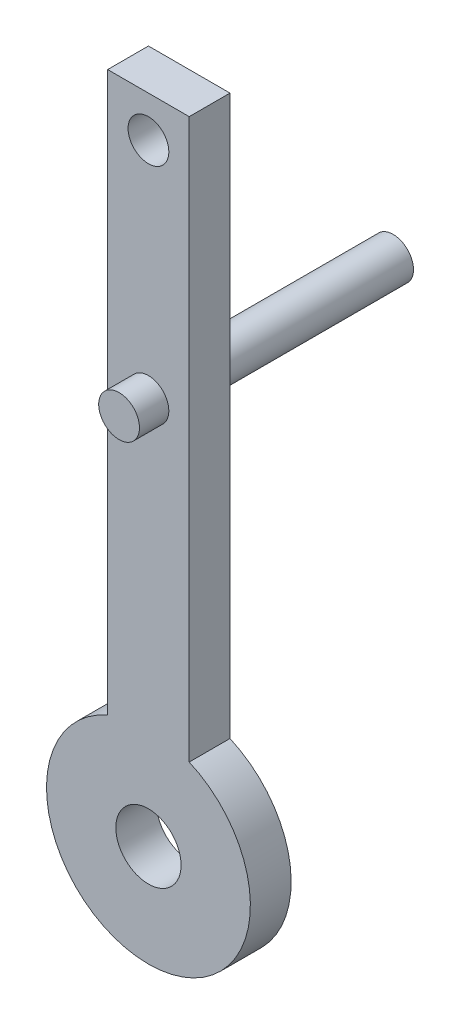
ISO-10303-21;
HEADER;
FILE_DESCRIPTION(('STEP AP214'),'2;1');
FILE_NAME('part.step','',(''),(''),'','','');
FILE_SCHEMA(('AUTOMOTIVE_DESIGN { 1 0 10303 214 1 1 1 1 }'));
ENDSEC;
DATA;
#1=APPLICATION_CONTEXT('core data for automotive mechanical design processes');
#2=APPLICATION_PROTOCOL_DEFINITION('international standard','automotive_design',2000,#1);
#3=PRODUCT_CONTEXT('',#1,'mechanical');
#4=PRODUCT('Part','Part','',(#3));
#5=PRODUCT_RELATED_PRODUCT_CATEGORY('part','',(#4));
#6=PRODUCT_DEFINITION_FORMATION('','',#4);
#7=PRODUCT_DEFINITION_CONTEXT('part definition',#1,'design');
#8=PRODUCT_DEFINITION('design','',#6,#7);
#9=PRODUCT_DEFINITION_SHAPE('','',#8);
#10=(LENGTH_UNIT() NAMED_UNIT(*) SI_UNIT(.MILLI.,.METRE.));
#11=(NAMED_UNIT(*) PLANE_ANGLE_UNIT() SI_UNIT($,.RADIAN.));
#12=(NAMED_UNIT(*) SI_UNIT($,.STERADIAN.) SOLID_ANGLE_UNIT());
#13=UNCERTAINTY_MEASURE_WITH_UNIT(LENGTH_MEASURE(1.E-05),#10,'distance_accuracy_value','');
#14=(GEOMETRIC_REPRESENTATION_CONTEXT(3) GLOBAL_UNCERTAINTY_ASSIGNED_CONTEXT((#13)) GLOBAL_UNIT_ASSIGNED_CONTEXT((#10,
#11,#12)) REPRESENTATION_CONTEXT('',''));
#15=CARTESIAN_POINT('',(0.,0.,0.));
#16=DIRECTION('',(0.,0.,1.));
#17=DIRECTION('',(1.,0.,0.));
#18=AXIS2_PLACEMENT_3D('',#15,#16,#17);
#19=CARTESIAN_POINT('',(5.,-11.4564392373896,5.));
#20=DIRECTION('',(0.,0.,1.));
#21=DIRECTION('',(1.,0.,0.));
#22=AXIS2_PLACEMENT_3D('',#19,#20,#21);
#23=PLANE('',#22);
#24=CARTESIAN_POINT('',(5.,36.0435607626104,5.));
#25=DIRECTION('',(0.,0.,1.));
#26=DIRECTION('',(1.,0.,0.));
#27=AXIS2_PLACEMENT_3D('',#24,#25,#26);
#28=CIRCLE('',#27,2.5);
#29=CARTESIAN_POINT('',(7.5,36.0435607626104,5.));
#30=VERTEX_POINT('',#29);
#31=EDGE_CURVE('E131',#30,#30,#28,.T.);
#32=ORIENTED_EDGE('',*,*,#31,.F.);
#33=EDGE_LOOP('',(#32));
#34=FACE_BOUND('',#33,.T.);
#35=CARTESIAN_POINT('',(5.,63.5435607626104,5.));
#36=DIRECTION('',(0.,0.,1.));
#37=DIRECTION('',(1.,0.,0.));
#38=AXIS2_PLACEMENT_3D('',#35,#36,#37);
#39=CIRCLE('',#38,2.5);
#40=CARTESIAN_POINT('',(7.5,63.5435607626104,5.));
#41=VERTEX_POINT('',#40);
#42=EDGE_CURVE('E125',#41,#41,#39,.T.);
#43=ORIENTED_EDGE('',*,*,#42,.F.);
#44=EDGE_LOOP('',(#43));
#45=FACE_BOUND('',#44,.T.);
#46=CARTESIAN_POINT('',(5.,-11.4564392373896,5.));
#47=DIRECTION('',(0.,0.,1.));
#48=DIRECTION('',(1.,0.,0.));
#49=AXIS2_PLACEMENT_3D('',#46,#47,#48);
#50=CIRCLE('',#49,12.5);
#51=CARTESIAN_POINT('',(0.,0.,5.));
#52=VERTEX_POINT('',#51);
#53=CARTESIAN_POINT('',(10.,0.,5.));
#54=VERTEX_POINT('',#53);
#55=EDGE_CURVE('E86',#52,#54,#50,.T.);
#56=ORIENTED_EDGE('',*,*,#55,.T.);
#57=DIRECTION('',(0.,1.,0.));
#58=VECTOR('',#57,1.);
#59=CARTESIAN_POINT('',(10.,0.,5.));
#60=LINE('',#59,#58);
#61=CARTESIAN_POINT('',(10.,68.5435607626104,5.));
#62=VERTEX_POINT('',#61);
#63=EDGE_CURVE('E81',#54,#62,#60,.T.);
#64=ORIENTED_EDGE('',*,*,#63,.T.);
#65=DIRECTION('',(-1.,0.,0.));
#66=VECTOR('',#65,1.);
#67=CARTESIAN_POINT('',(0.,68.5435607626104,5.));
#68=LINE('',#67,#66);
#69=CARTESIAN_POINT('',(0.,68.5435607626104,5.));
#70=VERTEX_POINT('',#69);
#71=EDGE_CURVE('E84',#62,#70,#68,.T.);
#72=ORIENTED_EDGE('',*,*,#71,.T.);
#73=DIRECTION('',(0.,-1.,0.));
#74=VECTOR('',#73,1.);
#75=CARTESIAN_POINT('',(0.,0.,5.));
#76=LINE('',#75,#74);
#77=EDGE_CURVE('E50',#70,#52,#76,.T.);
#78=ORIENTED_EDGE('',*,*,#77,.T.);
#79=EDGE_LOOP('',(#56,#64,#72,#78));
#80=FACE_BOUND('',#79,.T.);
#81=CARTESIAN_POINT('',(5.,-11.4564392373896,5.));
#82=DIRECTION('',(0.,0.,1.));
#83=DIRECTION('',(1.,0.,0.));
#84=AXIS2_PLACEMENT_3D('',#81,#82,#83);
#85=CIRCLE('',#84,4.);
#86=CARTESIAN_POINT('',(9.,-11.4564392373896,5.));
#87=VERTEX_POINT('',#86);
#88=EDGE_CURVE('E103',#87,#87,#85,.T.);
#89=ORIENTED_EDGE('',*,*,#88,.F.);
#90=EDGE_LOOP('',(#89));
#91=FACE_BOUND('',#90,.T.);
#92=ADVANCED_FACE('F33',(#34,#45,#80,#91),#23,.T.);
#93=CARTESIAN_POINT('',(5.,-11.4564392373896,0.));
#94=DIRECTION('',(0.,0.,1.));
#95=DIRECTION('',(1.,0.,0.));
#96=AXIS2_PLACEMENT_3D('',#93,#94,#95);
#97=PLANE('',#96);
#98=CARTESIAN_POINT('',(5.,36.0435607626104,0.));
#99=DIRECTION('',(0.,0.,1.));
#100=DIRECTION('',(1.,0.,0.));
#101=AXIS2_PLACEMENT_3D('',#98,#99,#100);
#102=CIRCLE('',#101,2.5);
#103=CARTESIAN_POINT('',(7.5,36.0435607626104,0.));
#104=VERTEX_POINT('',#103);
#105=EDGE_CURVE('E11',#104,#104,#102,.F.);
#106=ORIENTED_EDGE('',*,*,#105,.F.);
#107=EDGE_LOOP('',(#106));
#108=FACE_BOUND('',#107,.T.);
#109=CARTESIAN_POINT('',(5.,63.5435607626104,0.));
#110=DIRECTION('',(0.,0.,1.));
#111=DIRECTION('',(1.,0.,0.));
#112=AXIS2_PLACEMENT_3D('',#109,#110,#111);
#113=CIRCLE('',#112,2.5);
#114=CARTESIAN_POINT('',(7.5,63.5435607626104,0.));
#115=VERTEX_POINT('',#114);
#116=EDGE_CURVE('E120',#115,#115,#113,.T.);
#117=ORIENTED_EDGE('',*,*,#116,.T.);
#118=EDGE_LOOP('',(#117));
#119=FACE_BOUND('',#118,.T.);
#120=CARTESIAN_POINT('',(5.,-11.4564392373896,0.));
#121=DIRECTION('',(0.,0.,1.));
#122=DIRECTION('',(1.,0.,0.));
#123=AXIS2_PLACEMENT_3D('',#120,#121,#122);
#124=CIRCLE('',#123,12.5);
#125=CARTESIAN_POINT('',(0.,0.,0.));
#126=VERTEX_POINT('',#125);
#127=CARTESIAN_POINT('',(10.,0.,0.));
#128=VERTEX_POINT('',#127);
#129=EDGE_CURVE('E100',#126,#128,#124,.T.);
#130=ORIENTED_EDGE('',*,*,#129,.F.);
#131=DIRECTION('',(0.,-1.,0.));
#132=VECTOR('',#131,1.);
#133=CARTESIAN_POINT('',(0.,0.,0.));
#134=LINE('',#133,#132);
#135=CARTESIAN_POINT('',(0.,68.5435607626104,0.));
#136=VERTEX_POINT('',#135);
#137=EDGE_CURVE('E73',#136,#126,#134,.T.);
#138=ORIENTED_EDGE('',*,*,#137,.F.);
#139=DIRECTION('',(-1.,0.,0.));
#140=VECTOR('',#139,1.);
#141=CARTESIAN_POINT('',(0.,68.5435607626104,0.));
#142=LINE('',#141,#140);
#143=CARTESIAN_POINT('',(10.,68.5435607626104,0.));
#144=VERTEX_POINT('',#143);
#145=EDGE_CURVE('E67',#144,#136,#142,.T.);
#146=ORIENTED_EDGE('',*,*,#145,.F.);
#147=DIRECTION('',(0.,1.,0.));
#148=VECTOR('',#147,1.);
#149=CARTESIAN_POINT('',(10.,0.,0.));
#150=LINE('',#149,#148);
#151=EDGE_CURVE('E91',#128,#144,#150,.T.);
#152=ORIENTED_EDGE('',*,*,#151,.F.);
#153=EDGE_LOOP('',(#130,#138,#146,#152));
#154=FACE_BOUND('',#153,.T.);
#155=CARTESIAN_POINT('',(5.,-11.4564392373896,0.));
#156=DIRECTION('',(0.,0.,1.));
#157=DIRECTION('',(1.,0.,0.));
#158=AXIS2_PLACEMENT_3D('',#155,#156,#157);
#159=CIRCLE('',#158,4.);
#160=CARTESIAN_POINT('',(9.,-11.4564392373896,0.));
#161=VERTEX_POINT('',#160);
#162=EDGE_CURVE('E118',#161,#161,#159,.T.);
#163=ORIENTED_EDGE('',*,*,#162,.T.);
#164=EDGE_LOOP('',(#163));
#165=FACE_BOUND('',#164,.T.);
#166=ADVANCED_FACE('F111',(#108,#119,#154,#165),#97,.F.);
#167=CARTESIAN_POINT('',(5.,-11.4564392373896,5.));
#168=DIRECTION('',(0.,0.,-1.));
#169=DIRECTION('',(-1.,0.,0.));
#170=AXIS2_PLACEMENT_3D('',#167,#168,#169);
#171=CYLINDRICAL_SURFACE('',#170,12.5);
#172=ORIENTED_EDGE('',*,*,#129,.T.);
#173=DIRECTION('',(0.,0.,-1.));
#174=VECTOR('',#173,1.);
#175=CARTESIAN_POINT('',(10.,0.,5.));
#176=LINE('',#175,#174);
#177=EDGE_CURVE('E42',#54,#128,#176,.T.);
#178=ORIENTED_EDGE('',*,*,#177,.F.);
#179=ORIENTED_EDGE('',*,*,#55,.F.);
#180=DIRECTION('',(0.,0.,-1.));
#181=VECTOR('',#180,1.);
#182=CARTESIAN_POINT('',(0.,0.,5.));
#183=LINE('',#182,#181);
#184=EDGE_CURVE('E96',#52,#126,#183,.T.);
#185=ORIENTED_EDGE('',*,*,#184,.T.);
#186=EDGE_LOOP('',(#172,#178,#179,#185));
#187=FACE_BOUND('',#186,.T.);
#188=ADVANCED_FACE('F35',(#187),#171,.T.);
#189=CARTESIAN_POINT('',(10.,0.,5.));
#190=DIRECTION('',(-1.,0.,0.));
#191=DIRECTION('',(0.,-1.,0.));
#192=AXIS2_PLACEMENT_3D('',#189,#190,#191);
#193=PLANE('',#192);
#194=ORIENTED_EDGE('',*,*,#151,.T.);
#195=DIRECTION('',(0.,0.,-1.));
#196=VECTOR('',#195,1.);
#197=CARTESIAN_POINT('',(10.,68.5435607626104,5.));
#198=LINE('',#197,#196);
#199=EDGE_CURVE('E89',#62,#144,#198,.T.);
#200=ORIENTED_EDGE('',*,*,#199,.F.);
#201=ORIENTED_EDGE('',*,*,#63,.F.);
#202=ORIENTED_EDGE('',*,*,#177,.T.);
#203=EDGE_LOOP('',(#194,#200,#201,#202));
#204=FACE_BOUND('',#203,.T.);
#205=ADVANCED_FACE('F90',(#204),#193,.F.);
#206=CARTESIAN_POINT('',(0.,68.5435607626104,5.));
#207=DIRECTION('',(0.,-1.,0.));
#208=DIRECTION('',(0.,0.,-1.));
#209=AXIS2_PLACEMENT_3D('',#206,#207,#208);
#210=PLANE('',#209);
#211=ORIENTED_EDGE('',*,*,#145,.T.);
#212=DIRECTION('',(0.,0.,-1.));
#213=VECTOR('',#212,1.);
#214=CARTESIAN_POINT('',(0.,68.5435607626104,5.));
#215=LINE('',#214,#213);
#216=EDGE_CURVE('E92',#70,#136,#215,.T.);
#217=ORIENTED_EDGE('',*,*,#216,.F.);
#218=ORIENTED_EDGE('',*,*,#71,.F.);
#219=ORIENTED_EDGE('',*,*,#199,.T.);
#220=EDGE_LOOP('',(#211,#217,#218,#219));
#221=FACE_BOUND('',#220,.T.);
#222=ADVANCED_FACE('F94',(#221),#210,.F.);
#223=CARTESIAN_POINT('',(0.,0.,5.));
#224=DIRECTION('',(1.,0.,0.));
#225=DIRECTION('',(0.,0.,-1.));
#226=AXIS2_PLACEMENT_3D('',#223,#224,#225);
#227=PLANE('',#226);
#228=ORIENTED_EDGE('',*,*,#137,.T.);
#229=ORIENTED_EDGE('',*,*,#184,.F.);
#230=ORIENTED_EDGE('',*,*,#77,.F.);
#231=ORIENTED_EDGE('',*,*,#216,.T.);
#232=EDGE_LOOP('',(#228,#229,#230,#231));
#233=FACE_BOUND('',#232,.T.);
#234=ADVANCED_FACE('F167',(#233),#227,.F.);
#235=CARTESIAN_POINT('',(5.,-11.4564392373896,5.));
#236=DIRECTION('',(0.,0.,-1.));
#237=DIRECTION('',(-1.,0.,0.));
#238=AXIS2_PLACEMENT_3D('',#235,#236,#237);
#239=CYLINDRICAL_SURFACE('',#238,4.);
#240=ORIENTED_EDGE('',*,*,#88,.T.);
#241=EDGE_LOOP('',(#240));
#242=FACE_BOUND('',#241,.T.);
#243=ORIENTED_EDGE('',*,*,#162,.F.);
#244=EDGE_LOOP('',(#243));
#245=FACE_BOUND('',#244,.T.);
#246=ADVANCED_FACE('F155',(#242,#245),#239,.F.);
#247=CARTESIAN_POINT('',(5.,63.5435607626104,0.));
#248=DIRECTION('',(0.,0.,1.));
#249=DIRECTION('',(1.,0.,0.));
#250=AXIS2_PLACEMENT_3D('',#247,#248,#249);
#251=CYLINDRICAL_SURFACE('',#250,2.5);
#252=ORIENTED_EDGE('',*,*,#116,.F.);
#253=EDGE_LOOP('',(#252));
#254=FACE_BOUND('',#253,.T.);
#255=ORIENTED_EDGE('',*,*,#42,.T.);
#256=EDGE_LOOP('',(#255));
#257=FACE_BOUND('',#256,.T.);
#258=ADVANCED_FACE('F151',(#254,#257),#251,.F.);
#259=CARTESIAN_POINT('',(5.,36.0435607626104,8.6));
#260=DIRECTION('',(0.,0.,-1.));
#261=DIRECTION('',(-1.,0.,0.));
#262=AXIS2_PLACEMENT_3D('',#259,#260,#261);
#263=CYLINDRICAL_SURFACE('',#262,2.5);
#264=CARTESIAN_POINT('',(5.,36.0435607626104,8.6));
#265=DIRECTION('',(0.,0.,1.));
#266=DIRECTION('',(1.,0.,0.));
#267=AXIS2_PLACEMENT_3D('',#264,#265,#266);
#268=CIRCLE('',#267,2.5);
#269=CARTESIAN_POINT('',(7.5,36.0435607626104,8.6));
#270=VERTEX_POINT('',#269);
#271=EDGE_CURVE('E129',#270,#270,#268,.T.);
#272=ORIENTED_EDGE('',*,*,#271,.F.);
#273=EDGE_LOOP('',(#272));
#274=FACE_BOUND('',#273,.T.);
#275=ORIENTED_EDGE('',*,*,#31,.T.);
#276=EDGE_LOOP('',(#275));
#277=FACE_BOUND('',#276,.T.);
#278=ADVANCED_FACE('F154',(#274,#277),#263,.T.);
#279=CARTESIAN_POINT('',(5.,36.0435607626104,8.6));
#280=DIRECTION('',(0.,0.,1.));
#281=DIRECTION('',(1.,0.,0.));
#282=AXIS2_PLACEMENT_3D('',#279,#280,#281);
#283=PLANE('',#282);
#284=ORIENTED_EDGE('',*,*,#271,.T.);
#285=EDGE_LOOP('',(#284));
#286=FACE_BOUND('',#285,.T.);
#287=ADVANCED_FACE('F145',(#286),#283,.T.);
#288=CARTESIAN_POINT('',(5.,36.0435607626104,-25.));
#289=DIRECTION('',(0.,0.,1.));
#290=DIRECTION('',(1.,0.,0.));
#291=AXIS2_PLACEMENT_3D('',#288,#289,#290);
#292=CYLINDRICAL_SURFACE('',#291,2.5);
#293=CARTESIAN_POINT('',(5.,36.0435607626104,-25.));
#294=DIRECTION('',(0.,0.,-1.));
#295=DIRECTION('',(-1.,0.,0.));
#296=AXIS2_PLACEMENT_3D('',#293,#294,#295);
#297=CIRCLE('',#296,2.5);
#298=CARTESIAN_POINT('',(2.5,36.0435607626104,-25.));
#299=VERTEX_POINT('',#298);
#300=EDGE_CURVE('E134',#299,#299,#297,.T.);
#301=ORIENTED_EDGE('',*,*,#300,.F.);
#302=EDGE_LOOP('',(#301));
#303=FACE_BOUND('',#302,.T.);
#304=ORIENTED_EDGE('',*,*,#105,.T.);
#305=EDGE_LOOP('',(#304));
#306=FACE_BOUND('',#305,.T.);
#307=ADVANCED_FACE('F142',(#303,#306),#292,.T.);
#308=CARTESIAN_POINT('',(5.,36.0435607626104,-25.));
#309=DIRECTION('',(0.,0.,-1.));
#310=DIRECTION('',(-1.,0.,0.));
#311=AXIS2_PLACEMENT_3D('',#308,#309,#310);
#312=PLANE('',#311);
#313=ORIENTED_EDGE('',*,*,#300,.T.);
#314=EDGE_LOOP('',(#313));
#315=FACE_BOUND('',#314,.T.);
#316=ADVANCED_FACE('F140',(#315),#312,.T.);
#317=CLOSED_SHELL('',(#92,#166,#188,#205,#222,#234,#246,#258,#278,#287,#307,#316));
#318=MANIFOLD_SOLID_BREP('B2',#317);
#319=ADVANCED_BREP_SHAPE_REPRESENTATION('',(#18,#318),#14);
#320=SHAPE_DEFINITION_REPRESENTATION(#9,#319);
ENDSEC;
END-ISO-10303-21;
